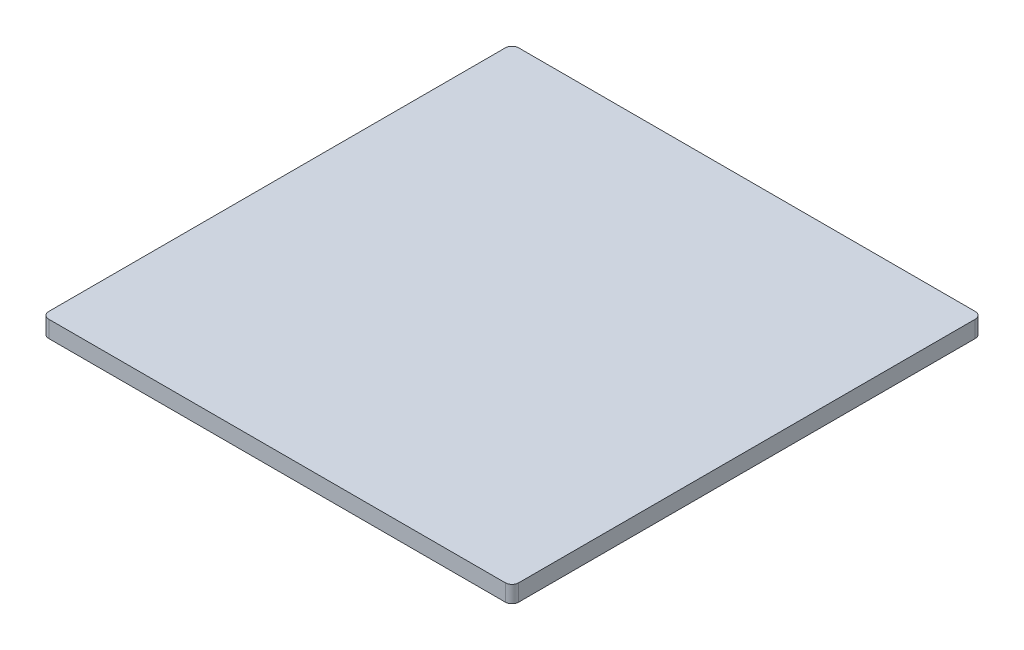
ISO-10303-21;
HEADER;
FILE_DESCRIPTION(('STEP AP214'),'2;1');
FILE_NAME('part.step','',(''),(''),'','','');
FILE_SCHEMA(('AUTOMOTIVE_DESIGN { 1 0 10303 214 1 1 1 1 }'));
ENDSEC;
DATA;
#1=APPLICATION_CONTEXT('core data for automotive mechanical design processes');
#2=APPLICATION_PROTOCOL_DEFINITION('international standard','automotive_design',2000,#1);
#3=PRODUCT_CONTEXT('',#1,'mechanical');
#4=PRODUCT('Part','Part','',(#3));
#5=PRODUCT_RELATED_PRODUCT_CATEGORY('part','',(#4));
#6=PRODUCT_DEFINITION_FORMATION('','',#4);
#7=PRODUCT_DEFINITION_CONTEXT('part definition',#1,'design');
#8=PRODUCT_DEFINITION('design','',#6,#7);
#9=PRODUCT_DEFINITION_SHAPE('','',#8);
#10=(LENGTH_UNIT() NAMED_UNIT(*) SI_UNIT(.MILLI.,.METRE.));
#11=(NAMED_UNIT(*) PLANE_ANGLE_UNIT() SI_UNIT($,.RADIAN.));
#12=(NAMED_UNIT(*) SI_UNIT($,.STERADIAN.) SOLID_ANGLE_UNIT());
#13=UNCERTAINTY_MEASURE_WITH_UNIT(LENGTH_MEASURE(1.E-05),#10,'distance_accuracy_value','');
#14=(GEOMETRIC_REPRESENTATION_CONTEXT(3) GLOBAL_UNCERTAINTY_ASSIGNED_CONTEXT((#13)) GLOBAL_UNIT_ASSIGNED_CONTEXT((#10,
#11,#12)) REPRESENTATION_CONTEXT('',''));
#15=CARTESIAN_POINT('',(0.,0.,0.));
#16=DIRECTION('',(0.,0.,1.));
#17=DIRECTION('',(1.,0.,0.));
#18=AXIS2_PLACEMENT_3D('',#15,#16,#17);
#19=CARTESIAN_POINT('',(-86.36,6.35,86.36));
#20=DIRECTION('',(0.,-1.,0.));
#21=DIRECTION('',(0.,0.,-1.));
#22=AXIS2_PLACEMENT_3D('',#19,#20,#21);
#23=CYLINDRICAL_SURFACE('',#22,2.54);
#24=CARTESIAN_POINT('',(-86.36,0.,86.36));
#25=DIRECTION('',(0.,1.,0.));
#26=DIRECTION('',(0.,0.,-1.));
#27=AXIS2_PLACEMENT_3D('',#24,#25,#26);
#28=CIRCLE('',#27,2.54);
#29=CARTESIAN_POINT('',(-88.9,0.,86.36));
#30=VERTEX_POINT('',#29);
#31=CARTESIAN_POINT('',(-86.36,0.,88.9));
#32=VERTEX_POINT('',#31);
#33=EDGE_CURVE('E146',#30,#32,#28,.T.);
#34=ORIENTED_EDGE('',*,*,#33,.T.);
#35=DIRECTION('',(0.,-1.,0.));
#36=VECTOR('',#35,1.);
#37=CARTESIAN_POINT('',(-86.36,6.35,88.9));
#38=LINE('',#37,#36);
#39=CARTESIAN_POINT('',(-86.36,6.35,88.9));
#40=VERTEX_POINT('',#39);
#41=EDGE_CURVE('E11',#40,#32,#38,.T.);
#42=ORIENTED_EDGE('',*,*,#41,.F.);
#43=CARTESIAN_POINT('',(-86.36,6.35,86.36));
#44=DIRECTION('',(0.,1.,0.));
#45=DIRECTION('',(0.,0.,-1.));
#46=AXIS2_PLACEMENT_3D('',#43,#44,#45);
#47=CIRCLE('',#46,2.54);
#48=CARTESIAN_POINT('',(-88.9,6.35,86.36));
#49=VERTEX_POINT('',#48);
#50=EDGE_CURVE('E168',#49,#40,#47,.T.);
#51=ORIENTED_EDGE('',*,*,#50,.F.);
#52=DIRECTION('',(0.,-1.,0.));
#53=VECTOR('',#52,1.);
#54=CARTESIAN_POINT('',(-88.9,6.35,86.36));
#55=LINE('',#54,#53);
#56=EDGE_CURVE('E142',#49,#30,#55,.T.);
#57=ORIENTED_EDGE('',*,*,#56,.T.);
#58=EDGE_LOOP('',(#34,#42,#51,#57));
#59=FACE_BOUND('',#58,.T.);
#60=ADVANCED_FACE('F45',(#59),#23,.T.);
#61=CARTESIAN_POINT('',(-86.36,6.35,88.9));
#62=DIRECTION('',(0.,0.,-1.));
#63=DIRECTION('',(-1.,0.,0.));
#64=AXIS2_PLACEMENT_3D('',#61,#62,#63);
#65=PLANE('',#64);
#66=DIRECTION('',(1.,0.,0.));
#67=VECTOR('',#66,1.);
#68=CARTESIAN_POINT('',(-86.36,0.,88.9));
#69=LINE('',#68,#67);
#70=CARTESIAN_POINT('',(86.36,0.,88.9));
#71=VERTEX_POINT('',#70);
#72=EDGE_CURVE('E150',#32,#71,#69,.T.);
#73=ORIENTED_EDGE('',*,*,#72,.T.);
#74=DIRECTION('',(0.,-1.,0.));
#75=VECTOR('',#74,1.);
#76=CARTESIAN_POINT('',(86.36,6.35,88.9));
#77=LINE('',#76,#75);
#78=CARTESIAN_POINT('',(86.36,6.35,88.9));
#79=VERTEX_POINT('',#78);
#80=EDGE_CURVE('E54',#79,#71,#77,.T.);
#81=ORIENTED_EDGE('',*,*,#80,.F.);
#82=DIRECTION('',(1.,0.,0.));
#83=VECTOR('',#82,1.);
#84=CARTESIAN_POINT('',(-86.36,6.35,88.9));
#85=LINE('',#84,#83);
#86=EDGE_CURVE('E105',#40,#79,#85,.T.);
#87=ORIENTED_EDGE('',*,*,#86,.F.);
#88=ORIENTED_EDGE('',*,*,#41,.T.);
#89=EDGE_LOOP('',(#73,#81,#87,#88));
#90=FACE_BOUND('',#89,.T.);
#91=ADVANCED_FACE('F214',(#90),#65,.F.);
#92=CARTESIAN_POINT('',(86.36,6.35,86.36));
#93=DIRECTION('',(0.,-1.,0.));
#94=DIRECTION('',(0.,0.,-1.));
#95=AXIS2_PLACEMENT_3D('',#92,#93,#94);
#96=CYLINDRICAL_SURFACE('',#95,2.54);
#97=CARTESIAN_POINT('',(86.36,0.,86.36));
#98=DIRECTION('',(0.,1.,0.));
#99=DIRECTION('',(0.,0.,1.));
#100=AXIS2_PLACEMENT_3D('',#97,#98,#99);
#101=CIRCLE('',#100,2.54);
#102=CARTESIAN_POINT('',(88.9,0.,86.36));
#103=VERTEX_POINT('',#102);
#104=EDGE_CURVE('E153',#71,#103,#101,.T.);
#105=ORIENTED_EDGE('',*,*,#104,.T.);
#106=DIRECTION('',(0.,-1.,0.));
#107=VECTOR('',#106,1.);
#108=CARTESIAN_POINT('',(88.9,6.35,86.36));
#109=LINE('',#108,#107);
#110=CARTESIAN_POINT('',(88.9,6.35,86.36));
#111=VERTEX_POINT('',#110);
#112=EDGE_CURVE('E179',#111,#103,#109,.T.);
#113=ORIENTED_EDGE('',*,*,#112,.F.);
#114=CARTESIAN_POINT('',(86.36,6.35,86.36));
#115=DIRECTION('',(0.,1.,0.));
#116=DIRECTION('',(0.,0.,1.));
#117=AXIS2_PLACEMENT_3D('',#114,#115,#116);
#118=CIRCLE('',#117,2.54);
#119=EDGE_CURVE('E189',#79,#111,#118,.T.);
#120=ORIENTED_EDGE('',*,*,#119,.F.);
#121=ORIENTED_EDGE('',*,*,#80,.T.);
#122=EDGE_LOOP('',(#105,#113,#120,#121));
#123=FACE_BOUND('',#122,.T.);
#124=ADVANCED_FACE('F187',(#123),#96,.T.);
#125=CARTESIAN_POINT('',(88.9,6.35,86.36));
#126=DIRECTION('',(-1.,0.,0.));
#127=DIRECTION('',(0.,0.,1.));
#128=AXIS2_PLACEMENT_3D('',#125,#126,#127);
#129=PLANE('',#128);
#130=DIRECTION('',(0.,0.,-1.));
#131=VECTOR('',#130,1.);
#132=CARTESIAN_POINT('',(88.9,0.,86.36));
#133=LINE('',#132,#131);
#134=CARTESIAN_POINT('',(88.9,0.,-86.36));
#135=VERTEX_POINT('',#134);
#136=EDGE_CURVE('E156',#103,#135,#133,.T.);
#137=ORIENTED_EDGE('',*,*,#136,.T.);
#138=DIRECTION('',(0.,-1.,0.));
#139=VECTOR('',#138,1.);
#140=CARTESIAN_POINT('',(88.9,6.35,-86.36));
#141=LINE('',#140,#139);
#142=CARTESIAN_POINT('',(88.9,6.35,-86.36));
#143=VERTEX_POINT('',#142);
#144=EDGE_CURVE('E175',#143,#135,#141,.T.);
#145=ORIENTED_EDGE('',*,*,#144,.F.);
#146=DIRECTION('',(0.,0.,-1.));
#147=VECTOR('',#146,1.);
#148=CARTESIAN_POINT('',(88.9,6.35,86.36));
#149=LINE('',#148,#147);
#150=EDGE_CURVE('E202',#111,#143,#149,.T.);
#151=ORIENTED_EDGE('',*,*,#150,.F.);
#152=ORIENTED_EDGE('',*,*,#112,.T.);
#153=EDGE_LOOP('',(#137,#145,#151,#152));
#154=FACE_BOUND('',#153,.T.);
#155=ADVANCED_FACE('F197',(#154),#129,.F.);
#156=CARTESIAN_POINT('',(86.36,6.35,-86.36));
#157=DIRECTION('',(0.,-1.,0.));
#158=DIRECTION('',(0.,0.,-1.));
#159=AXIS2_PLACEMENT_3D('',#156,#157,#158);
#160=CYLINDRICAL_SURFACE('',#159,2.54);
#161=CARTESIAN_POINT('',(86.36,0.,-86.36));
#162=DIRECTION('',(0.,1.,0.));
#163=DIRECTION('',(0.,0.,-1.));
#164=AXIS2_PLACEMENT_3D('',#161,#162,#163);
#165=CIRCLE('',#164,2.54);
#166=CARTESIAN_POINT('',(86.36,0.,-88.9));
#167=VERTEX_POINT('',#166);
#168=EDGE_CURVE('E159',#135,#167,#165,.T.);
#169=ORIENTED_EDGE('',*,*,#168,.T.);
#170=DIRECTION('',(0.,-1.,0.));
#171=VECTOR('',#170,1.);
#172=CARTESIAN_POINT('',(86.36,6.35,-88.9));
#173=LINE('',#172,#171);
#174=CARTESIAN_POINT('',(86.36,6.35,-88.9));
#175=VERTEX_POINT('',#174);
#176=EDGE_CURVE('E135',#175,#167,#173,.T.);
#177=ORIENTED_EDGE('',*,*,#176,.F.);
#178=CARTESIAN_POINT('',(86.36,6.35,-86.36));
#179=DIRECTION('',(0.,1.,0.));
#180=DIRECTION('',(0.,0.,-1.));
#181=AXIS2_PLACEMENT_3D('',#178,#179,#180);
#182=CIRCLE('',#181,2.54);
#183=EDGE_CURVE('E124',#143,#175,#182,.T.);
#184=ORIENTED_EDGE('',*,*,#183,.F.);
#185=ORIENTED_EDGE('',*,*,#144,.T.);
#186=EDGE_LOOP('',(#169,#177,#184,#185));
#187=FACE_BOUND('',#186,.T.);
#188=ADVANCED_FACE('F200',(#187),#160,.T.);
#189=CARTESIAN_POINT('',(-86.36,6.35,-88.9));
#190=DIRECTION('',(0.,0.,1.));
#191=DIRECTION('',(1.,0.,0.));
#192=AXIS2_PLACEMENT_3D('',#189,#190,#191);
#193=PLANE('',#192);
#194=DIRECTION('',(-1.,0.,0.));
#195=VECTOR('',#194,1.);
#196=CARTESIAN_POINT('',(-86.36,0.,-88.9));
#197=LINE('',#196,#195);
#198=CARTESIAN_POINT('',(-86.36,0.,-88.9));
#199=VERTEX_POINT('',#198);
#200=EDGE_CURVE('E133',#167,#199,#197,.T.);
#201=ORIENTED_EDGE('',*,*,#200,.T.);
#202=DIRECTION('',(0.,-1.,0.));
#203=VECTOR('',#202,1.);
#204=CARTESIAN_POINT('',(-86.36,6.35,-88.9));
#205=LINE('',#204,#203);
#206=CARTESIAN_POINT('',(-86.36,6.35,-88.9));
#207=VERTEX_POINT('',#206);
#208=EDGE_CURVE('E130',#207,#199,#205,.T.);
#209=ORIENTED_EDGE('',*,*,#208,.F.);
#210=DIRECTION('',(-1.,0.,0.));
#211=VECTOR('',#210,1.);
#212=CARTESIAN_POINT('',(-86.36,6.35,-88.9));
#213=LINE('',#212,#211);
#214=EDGE_CURVE('E118',#175,#207,#213,.T.);
#215=ORIENTED_EDGE('',*,*,#214,.F.);
#216=ORIENTED_EDGE('',*,*,#176,.T.);
#217=EDGE_LOOP('',(#201,#209,#215,#216));
#218=FACE_BOUND('',#217,.T.);
#219=ADVANCED_FACE('F131',(#218),#193,.F.);
#220=CARTESIAN_POINT('',(-86.36,6.35,-86.36));
#221=DIRECTION('',(0.,-1.,0.));
#222=DIRECTION('',(0.,0.,-1.));
#223=AXIS2_PLACEMENT_3D('',#220,#221,#222);
#224=CYLINDRICAL_SURFACE('',#223,2.54);
#225=CARTESIAN_POINT('',(-86.36,0.,-86.36));
#226=DIRECTION('',(0.,1.,0.));
#227=DIRECTION('',(0.,0.,-1.));
#228=AXIS2_PLACEMENT_3D('',#225,#226,#227);
#229=CIRCLE('',#228,2.54);
#230=CARTESIAN_POINT('',(-88.9,0.,-86.36));
#231=VERTEX_POINT('',#230);
#232=EDGE_CURVE('E91',#199,#231,#229,.T.);
#233=ORIENTED_EDGE('',*,*,#232,.T.);
#234=DIRECTION('',(0.,-1.,0.));
#235=VECTOR('',#234,1.);
#236=CARTESIAN_POINT('',(-88.9,6.35,-86.36));
#237=LINE('',#236,#235);
#238=CARTESIAN_POINT('',(-88.9,6.35,-86.36));
#239=VERTEX_POINT('',#238);
#240=EDGE_CURVE('E136',#239,#231,#237,.T.);
#241=ORIENTED_EDGE('',*,*,#240,.F.);
#242=CARTESIAN_POINT('',(-86.36,6.35,-86.36));
#243=DIRECTION('',(0.,1.,0.));
#244=DIRECTION('',(0.,0.,-1.));
#245=AXIS2_PLACEMENT_3D('',#242,#243,#244);
#246=CIRCLE('',#245,2.54);
#247=EDGE_CURVE('E122',#207,#239,#246,.T.);
#248=ORIENTED_EDGE('',*,*,#247,.F.);
#249=ORIENTED_EDGE('',*,*,#208,.T.);
#250=EDGE_LOOP('',(#233,#241,#248,#249));
#251=FACE_BOUND('',#250,.T.);
#252=ADVANCED_FACE('F138',(#251),#224,.T.);
#253=CARTESIAN_POINT('',(-88.9,6.35,86.36));
#254=DIRECTION('',(1.,0.,0.));
#255=DIRECTION('',(0.,0.,-1.));
#256=AXIS2_PLACEMENT_3D('',#253,#254,#255);
#257=PLANE('',#256);
#258=DIRECTION('',(0.,0.,1.));
#259=VECTOR('',#258,1.);
#260=CARTESIAN_POINT('',(-88.9,0.,86.36));
#261=LINE('',#260,#259);
#262=EDGE_CURVE('E97',#231,#30,#261,.T.);
#263=ORIENTED_EDGE('',*,*,#262,.T.);
#264=ORIENTED_EDGE('',*,*,#56,.F.);
#265=DIRECTION('',(0.,0.,1.));
#266=VECTOR('',#265,1.);
#267=CARTESIAN_POINT('',(-88.9,6.35,86.36));
#268=LINE('',#267,#266);
#269=EDGE_CURVE('E62',#239,#49,#268,.T.);
#270=ORIENTED_EDGE('',*,*,#269,.F.);
#271=ORIENTED_EDGE('',*,*,#240,.T.);
#272=EDGE_LOOP('',(#263,#264,#270,#271));
#273=FACE_BOUND('',#272,.T.);
#274=ADVANCED_FACE('F230',(#273),#257,.F.);
#275=CARTESIAN_POINT('',(-86.36,6.35,86.36));
#276=DIRECTION('',(0.,-1.,0.));
#277=DIRECTION('',(0.,0.,-1.));
#278=AXIS2_PLACEMENT_3D('',#275,#276,#277);
#279=PLANE('',#278);
#280=ORIENTED_EDGE('',*,*,#50,.T.);
#281=ORIENTED_EDGE('',*,*,#86,.T.);
#282=ORIENTED_EDGE('',*,*,#119,.T.);
#283=ORIENTED_EDGE('',*,*,#150,.T.);
#284=ORIENTED_EDGE('',*,*,#183,.T.);
#285=ORIENTED_EDGE('',*,*,#214,.T.);
#286=ORIENTED_EDGE('',*,*,#247,.T.);
#287=ORIENTED_EDGE('',*,*,#269,.T.);
#288=EDGE_LOOP('',(#280,#281,#282,#283,#284,#285,#286,#287));
#289=FACE_BOUND('',#288,.T.);
#290=ADVANCED_FACE('F120',(#289),#279,.F.);
#291=CARTESIAN_POINT('',(-86.36,0.,86.36));
#292=DIRECTION('',(0.,-1.,0.));
#293=DIRECTION('',(0.,0.,-1.));
#294=AXIS2_PLACEMENT_3D('',#291,#292,#293);
#295=PLANE('',#294);
#296=ORIENTED_EDGE('',*,*,#33,.F.);
#297=ORIENTED_EDGE('',*,*,#262,.F.);
#298=ORIENTED_EDGE('',*,*,#232,.F.);
#299=ORIENTED_EDGE('',*,*,#200,.F.);
#300=ORIENTED_EDGE('',*,*,#168,.F.);
#301=ORIENTED_EDGE('',*,*,#136,.F.);
#302=ORIENTED_EDGE('',*,*,#104,.F.);
#303=ORIENTED_EDGE('',*,*,#72,.F.);
#304=EDGE_LOOP('',(#296,#297,#298,#299,#300,#301,#302,#303));
#305=FACE_BOUND('',#304,.T.);
#306=ADVANCED_FACE('F193',(#305),#295,.T.);
#307=CLOSED_SHELL('',(#60,#91,#124,#155,#188,#219,#252,#274,#290,#306));
#308=MANIFOLD_SOLID_BREP('B2',#307);
#309=ADVANCED_BREP_SHAPE_REPRESENTATION('',(#18,#308),#14);
#310=SHAPE_DEFINITION_REPRESENTATION(#9,#309);
ENDSEC;
END-ISO-10303-21;
